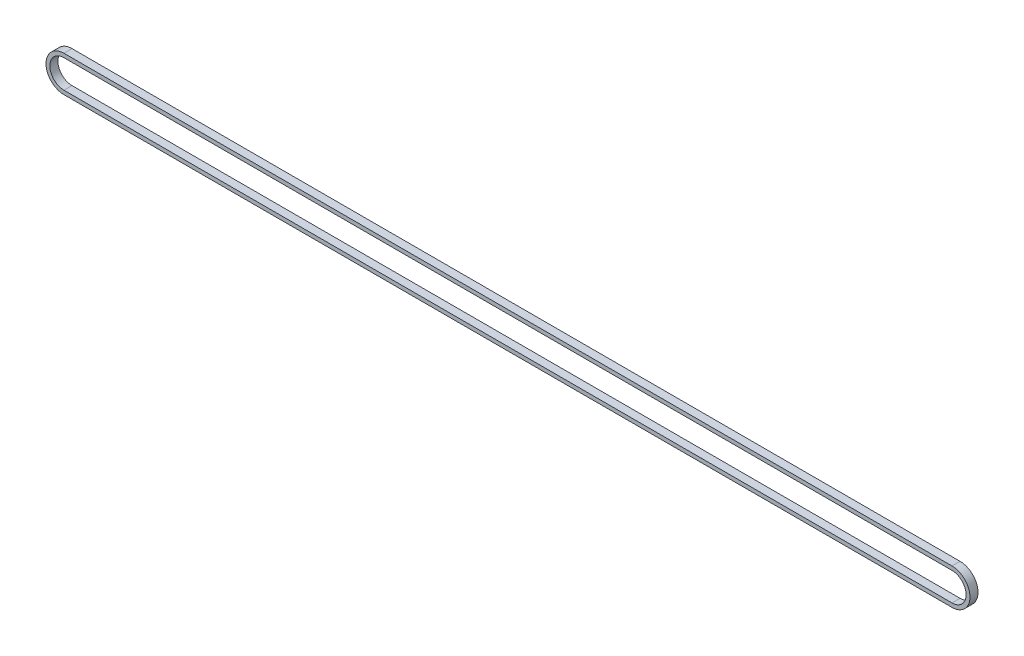
ISO-10303-21;
HEADER;
FILE_DESCRIPTION(('STEP AP214'),'2;1');
FILE_NAME('part.step','',(''),(''),'','','');
FILE_SCHEMA(('AUTOMOTIVE_DESIGN { 1 0 10303 214 1 1 1 1 }'));
ENDSEC;
DATA;
#1=APPLICATION_CONTEXT('core data for automotive mechanical design processes');
#2=APPLICATION_PROTOCOL_DEFINITION('international standard','automotive_design',2000,#1);
#3=PRODUCT_CONTEXT('',#1,'mechanical');
#4=PRODUCT('Part','Part','',(#3));
#5=PRODUCT_RELATED_PRODUCT_CATEGORY('part','',(#4));
#6=PRODUCT_DEFINITION_FORMATION('','',#4);
#7=PRODUCT_DEFINITION_CONTEXT('part definition',#1,'design');
#8=PRODUCT_DEFINITION('design','',#6,#7);
#9=PRODUCT_DEFINITION_SHAPE('','',#8);
#10=(LENGTH_UNIT() NAMED_UNIT(*) SI_UNIT(.MILLI.,.METRE.));
#11=(NAMED_UNIT(*) PLANE_ANGLE_UNIT() SI_UNIT($,.RADIAN.));
#12=(NAMED_UNIT(*) SI_UNIT($,.STERADIAN.) SOLID_ANGLE_UNIT());
#13=UNCERTAINTY_MEASURE_WITH_UNIT(LENGTH_MEASURE(1.E-05),#10,'distance_accuracy_value','');
#14=(GEOMETRIC_REPRESENTATION_CONTEXT(3) GLOBAL_UNCERTAINTY_ASSIGNED_CONTEXT((#13)) GLOBAL_UNIT_ASSIGNED_CONTEXT((#10,
#11,#12)) REPRESENTATION_CONTEXT('',''));
#15=CARTESIAN_POINT('',(0.,0.,0.));
#16=DIRECTION('',(0.,0.,1.));
#17=DIRECTION('',(1.,0.,0.));
#18=AXIS2_PLACEMENT_3D('',#15,#16,#17);
#19=CARTESIAN_POINT('',(0.,0.,2.5));
#20=DIRECTION('',(0.,0.,1.));
#21=DIRECTION('',(1.,0.,0.));
#22=AXIS2_PLACEMENT_3D('',#19,#20,#21);
#23=PLANE('',#22);
#24=CARTESIAN_POINT('',(0.,0.,2.5));
#25=DIRECTION('',(0.,0.,1.));
#26=DIRECTION('',(1.,0.,0.));
#27=AXIS2_PLACEMENT_3D('',#24,#25,#26);
#28=CIRCLE('',#27,11.15);
#29=CARTESIAN_POINT('',(0.,11.15,2.5));
#30=VERTEX_POINT('',#29);
#31=CARTESIAN_POINT('',(0.,-11.15,2.5));
#32=VERTEX_POINT('',#31);
#33=EDGE_CURVE('E157',#30,#32,#28,.T.);
#34=ORIENTED_EDGE('',*,*,#33,.T.);
#35=DIRECTION('',(1.,0.,0.));
#36=VECTOR('',#35,1.);
#37=CARTESIAN_POINT('',(551.8,-11.15,2.5));
#38=LINE('',#37,#36);
#39=CARTESIAN_POINT('',(551.8,-11.15,2.5));
#40=VERTEX_POINT('',#39);
#41=EDGE_CURVE('E160',#32,#40,#38,.T.);
#42=ORIENTED_EDGE('',*,*,#41,.T.);
#43=CARTESIAN_POINT('',(551.8,0.,2.5));
#44=DIRECTION('',(0.,0.,1.));
#45=DIRECTION('',(1.,0.,0.));
#46=AXIS2_PLACEMENT_3D('',#43,#44,#45);
#47=CIRCLE('',#46,11.15);
#48=CARTESIAN_POINT('',(551.8,11.15,2.5));
#49=VERTEX_POINT('',#48);
#50=EDGE_CURVE('E163',#40,#49,#47,.T.);
#51=ORIENTED_EDGE('',*,*,#50,.T.);
#52=DIRECTION('',(-1.,0.,0.));
#53=VECTOR('',#52,1.);
#54=CARTESIAN_POINT('',(0.,11.15,2.5));
#55=LINE('',#54,#53);
#56=EDGE_CURVE('E165',#49,#30,#55,.T.);
#57=ORIENTED_EDGE('',*,*,#56,.T.);
#58=EDGE_LOOP('',(#34,#42,#51,#57));
#59=FACE_BOUND('',#58,.T.);
#60=DIRECTION('',(1.,0.,0.));
#61=VECTOR('',#60,1.);
#62=CARTESIAN_POINT('',(551.8,-8.75,2.5));
#63=LINE('',#62,#61);
#64=CARTESIAN_POINT('',(0.,-8.75,2.5));
#65=VERTEX_POINT('',#64);
#66=CARTESIAN_POINT('',(551.8,-8.75,2.5));
#67=VERTEX_POINT('',#66);
#68=EDGE_CURVE('E129',#65,#67,#63,.T.);
#69=ORIENTED_EDGE('',*,*,#68,.F.);
#70=CARTESIAN_POINT('',(0.,0.,2.5));
#71=DIRECTION('',(0.,0.,1.));
#72=DIRECTION('',(1.,0.,0.));
#73=AXIS2_PLACEMENT_3D('',#70,#71,#72);
#74=CIRCLE('',#73,8.75);
#75=CARTESIAN_POINT('',(0.,8.75,2.5));
#76=VERTEX_POINT('',#75);
#77=EDGE_CURVE('E121',#76,#65,#74,.T.);
#78=ORIENTED_EDGE('',*,*,#77,.F.);
#79=DIRECTION('',(-1.,0.,0.));
#80=VECTOR('',#79,1.);
#81=CARTESIAN_POINT('',(0.,8.75,2.5));
#82=LINE('',#81,#80);
#83=CARTESIAN_POINT('',(551.8,8.75,2.5));
#84=VERTEX_POINT('',#83);
#85=EDGE_CURVE('E143',#84,#76,#82,.T.);
#86=ORIENTED_EDGE('',*,*,#85,.F.);
#87=CARTESIAN_POINT('',(551.8,0.,2.5));
#88=DIRECTION('',(0.,0.,1.));
#89=DIRECTION('',(1.,0.,0.));
#90=AXIS2_PLACEMENT_3D('',#87,#88,#89);
#91=CIRCLE('',#90,8.75);
#92=EDGE_CURVE('E141',#67,#84,#91,.T.);
#93=ORIENTED_EDGE('',*,*,#92,.F.);
#94=EDGE_LOOP('',(#69,#78,#86,#93));
#95=FACE_BOUND('',#94,.T.);
#96=ADVANCED_FACE('F56',(#59,#95),#23,.T.);
#97=CARTESIAN_POINT('',(0.,0.,-2.5));
#98=DIRECTION('',(0.,0.,1.));
#99=DIRECTION('',(1.,0.,0.));
#100=AXIS2_PLACEMENT_3D('',#97,#98,#99);
#101=PLANE('',#100);
#102=CARTESIAN_POINT('',(0.,0.,-2.5));
#103=DIRECTION('',(0.,0.,1.));
#104=DIRECTION('',(1.,0.,0.));
#105=AXIS2_PLACEMENT_3D('',#102,#103,#104);
#106=CIRCLE('',#105,11.15);
#107=CARTESIAN_POINT('',(0.,11.15,-2.5));
#108=VERTEX_POINT('',#107);
#109=CARTESIAN_POINT('',(0.,-11.15,-2.5));
#110=VERTEX_POINT('',#109);
#111=EDGE_CURVE('E137',#108,#110,#106,.T.);
#112=ORIENTED_EDGE('',*,*,#111,.F.);
#113=DIRECTION('',(-1.,0.,0.));
#114=VECTOR('',#113,1.);
#115=CARTESIAN_POINT('',(0.,11.15,-2.5));
#116=LINE('',#115,#114);
#117=CARTESIAN_POINT('',(551.8,11.15,-2.5));
#118=VERTEX_POINT('',#117);
#119=EDGE_CURVE('E161',#118,#108,#116,.T.);
#120=ORIENTED_EDGE('',*,*,#119,.F.);
#121=CARTESIAN_POINT('',(551.8,0.,-2.5));
#122=DIRECTION('',(0.,0.,1.));
#123=DIRECTION('',(1.,0.,0.));
#124=AXIS2_PLACEMENT_3D('',#121,#122,#123);
#125=CIRCLE('',#124,11.15);
#126=CARTESIAN_POINT('',(551.8,-11.15,-2.5));
#127=VERTEX_POINT('',#126);
#128=EDGE_CURVE('E172',#127,#118,#125,.T.);
#129=ORIENTED_EDGE('',*,*,#128,.F.);
#130=DIRECTION('',(1.,0.,0.));
#131=VECTOR('',#130,1.);
#132=CARTESIAN_POINT('',(551.8,-11.15,-2.5));
#133=LINE('',#132,#131);
#134=EDGE_CURVE('E170',#110,#127,#133,.T.);
#135=ORIENTED_EDGE('',*,*,#134,.F.);
#136=EDGE_LOOP('',(#112,#120,#129,#135));
#137=FACE_BOUND('',#136,.T.);
#138=CARTESIAN_POINT('',(0.,0.,-2.5));
#139=DIRECTION('',(0.,0.,1.));
#140=DIRECTION('',(1.,0.,0.));
#141=AXIS2_PLACEMENT_3D('',#138,#139,#140);
#142=CIRCLE('',#141,8.75);
#143=CARTESIAN_POINT('',(0.,8.75,-2.5));
#144=VERTEX_POINT('',#143);
#145=CARTESIAN_POINT('',(0.,-8.75,-2.5));
#146=VERTEX_POINT('',#145);
#147=EDGE_CURVE('E79',#144,#146,#142,.T.);
#148=ORIENTED_EDGE('',*,*,#147,.T.);
#149=DIRECTION('',(1.,0.,0.));
#150=VECTOR('',#149,1.);
#151=CARTESIAN_POINT('',(551.8,-8.75,-2.5));
#152=LINE('',#151,#150);
#153=CARTESIAN_POINT('',(551.8,-8.75,-2.5));
#154=VERTEX_POINT('',#153);
#155=EDGE_CURVE('E136',#146,#154,#152,.T.);
#156=ORIENTED_EDGE('',*,*,#155,.T.);
#157=CARTESIAN_POINT('',(551.8,0.,-2.5));
#158=DIRECTION('',(0.,0.,1.));
#159=DIRECTION('',(1.,0.,0.));
#160=AXIS2_PLACEMENT_3D('',#157,#158,#159);
#161=CIRCLE('',#160,8.75);
#162=CARTESIAN_POINT('',(551.8,8.75,-2.5));
#163=VERTEX_POINT('',#162);
#164=EDGE_CURVE('E149',#154,#163,#161,.T.);
#165=ORIENTED_EDGE('',*,*,#164,.T.);
#166=DIRECTION('',(-1.,0.,0.));
#167=VECTOR('',#166,1.);
#168=CARTESIAN_POINT('',(0.,8.75,-2.5));
#169=LINE('',#168,#167);
#170=EDGE_CURVE('E130',#163,#144,#169,.T.);
#171=ORIENTED_EDGE('',*,*,#170,.T.);
#172=EDGE_LOOP('',(#148,#156,#165,#171));
#173=FACE_BOUND('',#172,.T.);
#174=ADVANCED_FACE('F190',(#137,#173),#101,.F.);
#175=CARTESIAN_POINT('',(0.,0.,2.5));
#176=DIRECTION('',(0.,0.,-1.));
#177=DIRECTION('',(-1.,0.,0.));
#178=AXIS2_PLACEMENT_3D('',#175,#176,#177);
#179=CYLINDRICAL_SURFACE('',#178,11.15);
#180=ORIENTED_EDGE('',*,*,#111,.T.);
#181=DIRECTION('',(0.,0.,-1.));
#182=VECTOR('',#181,1.);
#183=CARTESIAN_POINT('',(0.,-11.15,2.5));
#184=LINE('',#183,#182);
#185=EDGE_CURVE('E12',#32,#110,#184,.T.);
#186=ORIENTED_EDGE('',*,*,#185,.F.);
#187=ORIENTED_EDGE('',*,*,#33,.F.);
#188=DIRECTION('',(0.,0.,-1.));
#189=VECTOR('',#188,1.);
#190=CARTESIAN_POINT('',(0.,11.15,2.5));
#191=LINE('',#190,#189);
#192=EDGE_CURVE('E167',#30,#108,#191,.T.);
#193=ORIENTED_EDGE('',*,*,#192,.T.);
#194=EDGE_LOOP('',(#180,#186,#187,#193));
#195=FACE_BOUND('',#194,.T.);
#196=ADVANCED_FACE('F58',(#195),#179,.T.);
#197=CARTESIAN_POINT('',(551.8,-11.15,2.5));
#198=DIRECTION('',(0.,1.,0.));
#199=DIRECTION('',(0.,0.,1.));
#200=AXIS2_PLACEMENT_3D('',#197,#198,#199);
#201=PLANE('',#200);
#202=ORIENTED_EDGE('',*,*,#134,.T.);
#203=DIRECTION('',(0.,0.,-1.));
#204=VECTOR('',#203,1.);
#205=CARTESIAN_POINT('',(551.8,-11.15,2.5));
#206=LINE('',#205,#204);
#207=EDGE_CURVE('E64',#40,#127,#206,.T.);
#208=ORIENTED_EDGE('',*,*,#207,.F.);
#209=ORIENTED_EDGE('',*,*,#41,.F.);
#210=ORIENTED_EDGE('',*,*,#185,.T.);
#211=EDGE_LOOP('',(#202,#208,#209,#210));
#212=FACE_BOUND('',#211,.T.);
#213=ADVANCED_FACE('F200',(#212),#201,.F.);
#214=CARTESIAN_POINT('',(551.8,0.,2.5));
#215=DIRECTION('',(0.,0.,-1.));
#216=DIRECTION('',(-1.,0.,0.));
#217=AXIS2_PLACEMENT_3D('',#214,#215,#216);
#218=CYLINDRICAL_SURFACE('',#217,11.15);
#219=ORIENTED_EDGE('',*,*,#128,.T.);
#220=DIRECTION('',(0.,0.,-1.));
#221=VECTOR('',#220,1.);
#222=CARTESIAN_POINT('',(551.8,11.15,2.5));
#223=LINE('',#222,#221);
#224=EDGE_CURVE('E177',#49,#118,#223,.T.);
#225=ORIENTED_EDGE('',*,*,#224,.F.);
#226=ORIENTED_EDGE('',*,*,#50,.F.);
#227=ORIENTED_EDGE('',*,*,#207,.T.);
#228=EDGE_LOOP('',(#219,#225,#226,#227));
#229=FACE_BOUND('',#228,.T.);
#230=ADVANCED_FACE('F184',(#229),#218,.T.);
#231=CARTESIAN_POINT('',(0.,11.15,2.5));
#232=DIRECTION('',(0.,-1.,0.));
#233=DIRECTION('',(0.,0.,-1.));
#234=AXIS2_PLACEMENT_3D('',#231,#232,#233);
#235=PLANE('',#234);
#236=ORIENTED_EDGE('',*,*,#119,.T.);
#237=ORIENTED_EDGE('',*,*,#192,.F.);
#238=ORIENTED_EDGE('',*,*,#56,.F.);
#239=ORIENTED_EDGE('',*,*,#224,.T.);
#240=EDGE_LOOP('',(#236,#237,#238,#239));
#241=FACE_BOUND('',#240,.T.);
#242=ADVANCED_FACE('F194',(#241),#235,.F.);
#243=CARTESIAN_POINT('',(0.,0.,2.5));
#244=DIRECTION('',(0.,0.,-1.));
#245=DIRECTION('',(-1.,0.,0.));
#246=AXIS2_PLACEMENT_3D('',#243,#244,#245);
#247=CYLINDRICAL_SURFACE('',#246,8.75);
#248=ORIENTED_EDGE('',*,*,#147,.F.);
#249=DIRECTION('',(0.,0.,-1.));
#250=VECTOR('',#249,1.);
#251=CARTESIAN_POINT('',(0.,8.75,2.5));
#252=LINE('',#251,#250);
#253=EDGE_CURVE('E125',#76,#144,#252,.T.);
#254=ORIENTED_EDGE('',*,*,#253,.F.);
#255=ORIENTED_EDGE('',*,*,#77,.T.);
#256=DIRECTION('',(0.,0.,-1.));
#257=VECTOR('',#256,1.);
#258=CARTESIAN_POINT('',(0.,-8.75,2.5));
#259=LINE('',#258,#257);
#260=EDGE_CURVE('E124',#65,#146,#259,.T.);
#261=ORIENTED_EDGE('',*,*,#260,.T.);
#262=EDGE_LOOP('',(#248,#254,#255,#261));
#263=FACE_BOUND('',#262,.T.);
#264=ADVANCED_FACE('F123',(#263),#247,.F.);
#265=CARTESIAN_POINT('',(551.8,-8.75,2.5));
#266=DIRECTION('',(0.,1.,0.));
#267=DIRECTION('',(0.,0.,1.));
#268=AXIS2_PLACEMENT_3D('',#265,#266,#267);
#269=PLANE('',#268);
#270=ORIENTED_EDGE('',*,*,#155,.F.);
#271=ORIENTED_EDGE('',*,*,#260,.F.);
#272=ORIENTED_EDGE('',*,*,#68,.T.);
#273=DIRECTION('',(0.,0.,-1.));
#274=VECTOR('',#273,1.);
#275=CARTESIAN_POINT('',(551.8,-8.75,2.5));
#276=LINE('',#275,#274);
#277=EDGE_CURVE('E138',#67,#154,#276,.T.);
#278=ORIENTED_EDGE('',*,*,#277,.T.);
#279=EDGE_LOOP('',(#270,#271,#272,#278));
#280=FACE_BOUND('',#279,.T.);
#281=ADVANCED_FACE('F133',(#280),#269,.T.);
#282=CARTESIAN_POINT('',(551.8,0.,2.5));
#283=DIRECTION('',(0.,0.,-1.));
#284=DIRECTION('',(-1.,0.,0.));
#285=AXIS2_PLACEMENT_3D('',#282,#283,#284);
#286=CYLINDRICAL_SURFACE('',#285,8.75);
#287=ORIENTED_EDGE('',*,*,#164,.F.);
#288=ORIENTED_EDGE('',*,*,#277,.F.);
#289=ORIENTED_EDGE('',*,*,#92,.T.);
#290=DIRECTION('',(0.,0.,-1.));
#291=VECTOR('',#290,1.);
#292=CARTESIAN_POINT('',(551.8,8.75,2.5));
#293=LINE('',#292,#291);
#294=EDGE_CURVE('E71',#84,#163,#293,.T.);
#295=ORIENTED_EDGE('',*,*,#294,.T.);
#296=EDGE_LOOP('',(#287,#288,#289,#295));
#297=FACE_BOUND('',#296,.T.);
#298=ADVANCED_FACE('F223',(#297),#286,.F.);
#299=CARTESIAN_POINT('',(0.,8.75,2.5));
#300=DIRECTION('',(0.,-1.,0.));
#301=DIRECTION('',(0.,0.,-1.));
#302=AXIS2_PLACEMENT_3D('',#299,#300,#301);
#303=PLANE('',#302);
#304=ORIENTED_EDGE('',*,*,#170,.F.);
#305=ORIENTED_EDGE('',*,*,#294,.F.);
#306=ORIENTED_EDGE('',*,*,#85,.T.);
#307=ORIENTED_EDGE('',*,*,#253,.T.);
#308=EDGE_LOOP('',(#304,#305,#306,#307));
#309=FACE_BOUND('',#308,.T.);
#310=ADVANCED_FACE('F227',(#309),#303,.T.);
#311=CLOSED_SHELL('',(#96,#174,#196,#213,#230,#242,#264,#281,#298,#310));
#312=MANIFOLD_SOLID_BREP('B2',#311);
#313=ADVANCED_BREP_SHAPE_REPRESENTATION('',(#18,#312),#14);
#314=SHAPE_DEFINITION_REPRESENTATION(#9,#313);
ENDSEC;
END-ISO-10303-21;
